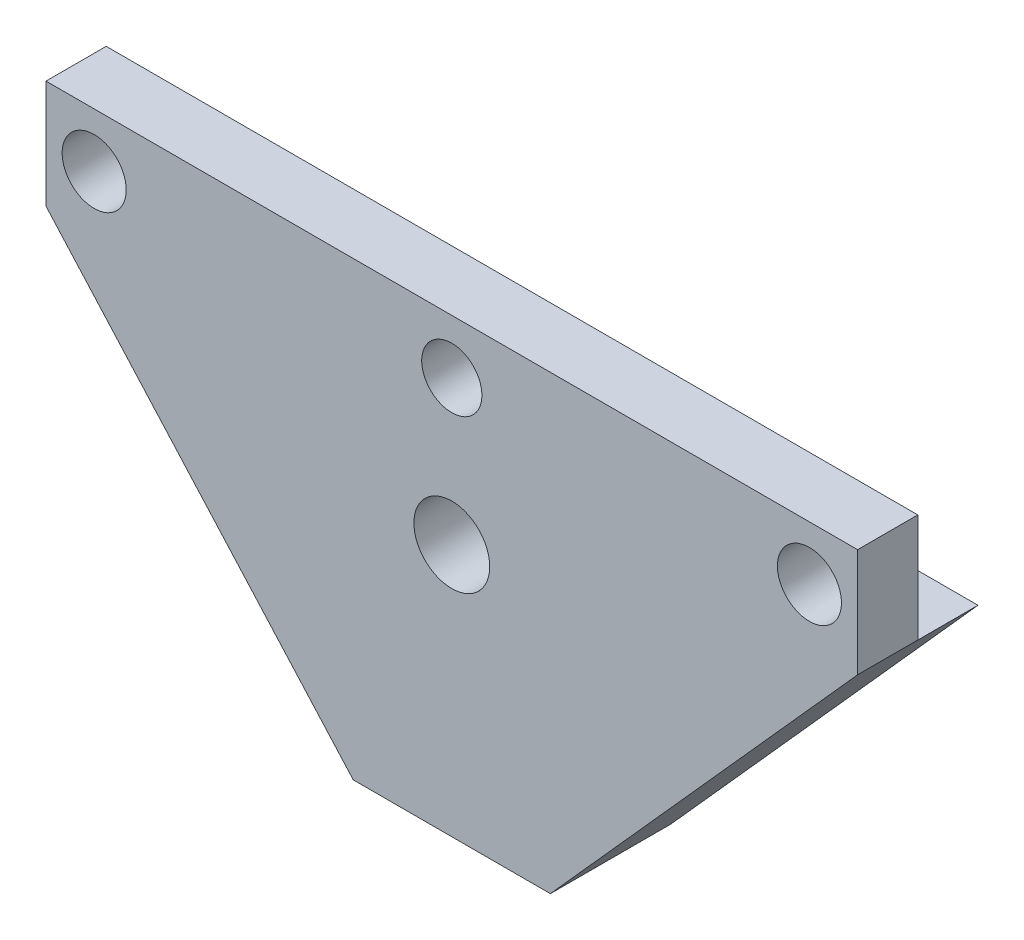
ISO-10303-21;
HEADER;
FILE_DESCRIPTION(('STEP AP214'),'2;1');
FILE_NAME('part.step','',(''),(''),'','','');
FILE_SCHEMA(('AUTOMOTIVE_DESIGN { 1 0 10303 214 1 1 1 1 }'));
ENDSEC;
DATA;
#1=APPLICATION_CONTEXT('core data for automotive mechanical design processes');
#2=APPLICATION_PROTOCOL_DEFINITION('international standard','automotive_design',2000,#1);
#3=PRODUCT_CONTEXT('',#1,'mechanical');
#4=PRODUCT('Part','Part','',(#3));
#5=PRODUCT_RELATED_PRODUCT_CATEGORY('part','',(#4));
#6=PRODUCT_DEFINITION_FORMATION('','',#4);
#7=PRODUCT_DEFINITION_CONTEXT('part definition',#1,'design');
#8=PRODUCT_DEFINITION('design','',#6,#7);
#9=PRODUCT_DEFINITION_SHAPE('','',#8);
#10=(LENGTH_UNIT() NAMED_UNIT(*) SI_UNIT(.MILLI.,.METRE.));
#11=(NAMED_UNIT(*) PLANE_ANGLE_UNIT() SI_UNIT($,.RADIAN.));
#12=(NAMED_UNIT(*) SI_UNIT($,.STERADIAN.) SOLID_ANGLE_UNIT());
#13=UNCERTAINTY_MEASURE_WITH_UNIT(LENGTH_MEASURE(1.E-05),#10,'distance_accuracy_value','');
#14=(GEOMETRIC_REPRESENTATION_CONTEXT(3) GLOBAL_UNCERTAINTY_ASSIGNED_CONTEXT((#13)) GLOBAL_UNIT_ASSIGNED_CONTEXT((#10,
#11,#12)) REPRESENTATION_CONTEXT('',''));
#15=CARTESIAN_POINT('',(0.,0.,0.));
#16=DIRECTION('',(0.,0.,1.));
#17=DIRECTION('',(1.,0.,0.));
#18=AXIS2_PLACEMENT_3D('',#15,#16,#17);
#19=CARTESIAN_POINT('',(-42.8001305488663,-5.71500000000003,-12.7));
#20=DIRECTION('',(-1.,0.,0.));
#21=DIRECTION('',(0.,-1.,0.));
#22=AXIS2_PLACEMENT_3D('',#19,#20,#21);
#23=PLANE('',#22);
#24=DIRECTION('',(0.,-1.,0.));
#25=VECTOR('',#24,1.);
#26=CARTESIAN_POINT('',(-42.8001305488663,5.71500000000011,-6.35));
#27=LINE('',#26,#25);
#28=CARTESIAN_POINT('',(-42.8001305488663,5.71500000000011,-6.35));
#29=VERTEX_POINT('',#28);
#30=CARTESIAN_POINT('',(-42.8001305488663,-5.71499999999991,-6.35));
#31=VERTEX_POINT('',#30);
#32=EDGE_CURVE('E108',#29,#31,#27,.T.);
#33=ORIENTED_EDGE('',*,*,#32,.T.);
#34=DIRECTION('',(0.,0.,1.));
#35=VECTOR('',#34,1.);
#36=CARTESIAN_POINT('',(-42.8001305488663,-5.71500000000003,-12.7));
#37=LINE('',#36,#35);
#38=CARTESIAN_POINT('',(-42.8001305488663,-5.71500000000003,0.));
#39=VERTEX_POINT('',#38);
#40=EDGE_CURVE('E124',#31,#39,#37,.T.);
#41=ORIENTED_EDGE('',*,*,#40,.T.);
#42=DIRECTION('',(0.,-1.,0.));
#43=VECTOR('',#42,1.);
#44=CARTESIAN_POINT('',(-42.8001305488663,-5.71500000000003,0.));
#45=LINE('',#44,#43);
#46=CARTESIAN_POINT('',(-42.8001305488663,5.715,0.));
#47=VERTEX_POINT('',#46);
#48=EDGE_CURVE('E122',#47,#39,#45,.T.);
#49=ORIENTED_EDGE('',*,*,#48,.F.);
#50=DIRECTION('',(0.,0.,1.));
#51=VECTOR('',#50,1.);
#52=CARTESIAN_POINT('',(-42.8001305488663,5.715,-12.7));
#53=LINE('',#52,#51);
#54=EDGE_CURVE('E11',#29,#47,#53,.T.);
#55=ORIENTED_EDGE('',*,*,#54,.F.);
#56=EDGE_LOOP('',(#33,#41,#49,#55));
#57=FACE_BOUND('',#56,.T.);
#58=ADVANCED_FACE('F39',(#57),#23,.T.);
#59=CARTESIAN_POINT('',(-42.8001305488663,5.715,-12.7));
#60=DIRECTION('',(0.,1.,0.));
#61=DIRECTION('',(-1.,0.,0.));
#62=AXIS2_PLACEMENT_3D('',#59,#60,#61);
#63=PLANE('',#62);
#64=DIRECTION('',(1.,0.,0.));
#65=VECTOR('',#64,1.);
#66=CARTESIAN_POINT('',(-42.8001305488663,5.71500000000011,-6.35));
#67=LINE('',#66,#65);
#68=CARTESIAN_POINT('',(42.8001305488663,5.71500000000001,-6.35));
#69=VERTEX_POINT('',#68);
#70=EDGE_CURVE('E112',#29,#69,#67,.T.);
#71=ORIENTED_EDGE('',*,*,#70,.F.);
#72=ORIENTED_EDGE('',*,*,#54,.T.);
#73=DIRECTION('',(-1.,0.,0.));
#74=VECTOR('',#73,1.);
#75=CARTESIAN_POINT('',(-42.8001305488663,5.715,0.));
#76=LINE('',#75,#74);
#77=CARTESIAN_POINT('',(42.8001305488663,5.71500000000001,0.));
#78=VERTEX_POINT('',#77);
#79=EDGE_CURVE('E131',#78,#47,#76,.T.);
#80=ORIENTED_EDGE('',*,*,#79,.F.);
#81=DIRECTION('',(0.,0.,1.));
#82=VECTOR('',#81,1.);
#83=CARTESIAN_POINT('',(42.8001305488663,5.71500000000001,-12.7));
#84=LINE('',#83,#82);
#85=EDGE_CURVE('E48',#69,#78,#84,.T.);
#86=ORIENTED_EDGE('',*,*,#85,.F.);
#87=EDGE_LOOP('',(#71,#72,#80,#86));
#88=FACE_BOUND('',#87,.T.);
#89=ADVANCED_FACE('F119',(#88),#63,.T.);
#90=CARTESIAN_POINT('',(42.8001305488663,-5.71500000000002,-12.7));
#91=DIRECTION('',(1.,0.,0.));
#92=DIRECTION('',(0.,1.,0.));
#93=AXIS2_PLACEMENT_3D('',#90,#91,#92);
#94=PLANE('',#93);
#95=DIRECTION('',(0.,-1.,0.));
#96=VECTOR('',#95,1.);
#97=CARTESIAN_POINT('',(42.8001305488663,5.71500000000001,-6.35));
#98=LINE('',#97,#96);
#99=CARTESIAN_POINT('',(42.8001305488663,-5.71500000000002,-6.35));
#100=VERTEX_POINT('',#99);
#101=EDGE_CURVE('E117',#69,#100,#98,.T.);
#102=ORIENTED_EDGE('',*,*,#101,.F.);
#103=ORIENTED_EDGE('',*,*,#85,.T.);
#104=DIRECTION('',(0.,1.,0.));
#105=VECTOR('',#104,1.);
#106=CARTESIAN_POINT('',(42.8001305488663,-5.71500000000002,0.));
#107=LINE('',#106,#105);
#108=CARTESIAN_POINT('',(42.8001305488663,-5.71500000000002,0.));
#109=VERTEX_POINT('',#108);
#110=EDGE_CURVE('E134',#109,#78,#107,.T.);
#111=ORIENTED_EDGE('',*,*,#110,.F.);
#112=DIRECTION('',(0.,0.,1.));
#113=VECTOR('',#112,1.);
#114=CARTESIAN_POINT('',(42.8001305488663,-5.71500000000002,-12.7));
#115=LINE('',#114,#113);
#116=EDGE_CURVE('E146',#100,#109,#115,.T.);
#117=ORIENTED_EDGE('',*,*,#116,.F.);
#118=EDGE_LOOP('',(#102,#103,#111,#117));
#119=FACE_BOUND('',#118,.T.);
#120=ADVANCED_FACE('F164',(#119),#94,.T.);
#121=CARTESIAN_POINT('',(10.395398020278,-41.91,-12.7));
#122=DIRECTION('',(0.745039441543224,-0.667020412390026,0.));
#123=DIRECTION('',(0.667020412390026,0.745039441543224,0.));
#124=AXIS2_PLACEMENT_3D('',#121,#122,#123);
#125=PLANE('',#124);
#126=DIRECTION('',(0.667020412390026,0.745039441543224,0.));
#127=VECTOR('',#126,1.);
#128=CARTESIAN_POINT('',(10.395398020278,-41.91,0.));
#129=LINE('',#128,#127);
#130=CARTESIAN_POINT('',(10.395398020278,-41.91,0.));
#131=VERTEX_POINT('',#130);
#132=EDGE_CURVE('E140',#131,#109,#129,.T.);
#133=ORIENTED_EDGE('',*,*,#132,.F.);
#134=DIRECTION('',(0.,0.,1.));
#135=VECTOR('',#134,1.);
#136=CARTESIAN_POINT('',(10.395398020278,-41.91,-12.7));
#137=LINE('',#136,#135);
#138=CARTESIAN_POINT('',(10.395398020278,-41.91,-12.7));
#139=VERTEX_POINT('',#138);
#140=EDGE_CURVE('E147',#139,#131,#137,.T.);
#141=ORIENTED_EDGE('',*,*,#140,.F.);
#142=DIRECTION('',(0.667020412390026,0.745039441543224,0.));
#143=VECTOR('',#142,1.);
#144=CARTESIAN_POINT('',(10.395398020278,-41.91,-12.7));
#145=LINE('',#144,#143);
#146=CARTESIAN_POINT('',(42.8001305488663,-5.71500000000002,-12.7));
#147=VERTEX_POINT('',#146);
#148=EDGE_CURVE('E151',#139,#147,#145,.T.);
#149=ORIENTED_EDGE('',*,*,#148,.T.);
#150=EDGE_CURVE('E57',#147,#100,#115,.T.);
#151=ORIENTED_EDGE('',*,*,#150,.T.);
#152=ORIENTED_EDGE('',*,*,#116,.T.);
#153=EDGE_LOOP('',(#133,#141,#149,#151,#152));
#154=FACE_BOUND('',#153,.T.);
#155=ADVANCED_FACE('F162',(#154),#125,.T.);
#156=CARTESIAN_POINT('',(-10.395398020278,-41.91,-12.7));
#157=DIRECTION('',(0.,-1.,0.));
#158=DIRECTION('',(0.,0.,-1.));
#159=AXIS2_PLACEMENT_3D('',#156,#157,#158);
#160=PLANE('',#159);
#161=DIRECTION('',(1.,0.,0.));
#162=VECTOR('',#161,1.);
#163=CARTESIAN_POINT('',(-10.395398020278,-41.91,0.));
#164=LINE('',#163,#162);
#165=CARTESIAN_POINT('',(-10.395398020278,-41.91,0.));
#166=VERTEX_POINT('',#165);
#167=EDGE_CURVE('E159',#166,#131,#164,.T.);
#168=ORIENTED_EDGE('',*,*,#167,.F.);
#169=DIRECTION('',(0.,0.,1.));
#170=VECTOR('',#169,1.);
#171=CARTESIAN_POINT('',(-10.395398020278,-41.91,-12.7));
#172=LINE('',#171,#170);
#173=CARTESIAN_POINT('',(-10.395398020278,-41.91,-12.7));
#174=VERTEX_POINT('',#173);
#175=EDGE_CURVE('E92',#174,#166,#172,.T.);
#176=ORIENTED_EDGE('',*,*,#175,.F.);
#177=DIRECTION('',(1.,0.,0.));
#178=VECTOR('',#177,1.);
#179=CARTESIAN_POINT('',(-10.395398020278,-41.91,-12.7));
#180=LINE('',#179,#178);
#181=EDGE_CURVE('E138',#174,#139,#180,.T.);
#182=ORIENTED_EDGE('',*,*,#181,.T.);
#183=ORIENTED_EDGE('',*,*,#140,.T.);
#184=EDGE_LOOP('',(#168,#176,#182,#183));
#185=FACE_BOUND('',#184,.T.);
#186=ADVANCED_FACE('F171',(#185),#160,.T.);
#187=CARTESIAN_POINT('',(-42.8001305488663,-5.71500000000003,-12.7));
#188=DIRECTION('',(-0.745039441543224,-0.667020412390026,0.));
#189=DIRECTION('',(0.667020412390026,-0.745039441543224,0.));
#190=AXIS2_PLACEMENT_3D('',#187,#188,#189);
#191=PLANE('',#190);
#192=DIRECTION('',(0.667020412390026,-0.745039441543224,0.));
#193=VECTOR('',#192,1.);
#194=CARTESIAN_POINT('',(-42.8001305488663,-5.71500000000003,0.));
#195=LINE('',#194,#193);
#196=EDGE_CURVE('E128',#39,#166,#195,.T.);
#197=ORIENTED_EDGE('',*,*,#196,.F.);
#198=ORIENTED_EDGE('',*,*,#40,.F.);
#199=CARTESIAN_POINT('',(-42.8001305488663,-5.71499999999991,-12.7));
#200=VERTEX_POINT('',#199);
#201=EDGE_CURVE('E149',#200,#31,#37,.T.);
#202=ORIENTED_EDGE('',*,*,#201,.F.);
#203=DIRECTION('',(0.667020412390026,-0.745039441543224,0.));
#204=VECTOR('',#203,1.);
#205=CARTESIAN_POINT('',(-42.8001305488663,-5.71500000000003,-12.7));
#206=LINE('',#205,#204);
#207=EDGE_CURVE('E135',#200,#174,#206,.T.);
#208=ORIENTED_EDGE('',*,*,#207,.T.);
#209=ORIENTED_EDGE('',*,*,#175,.T.);
#210=EDGE_LOOP('',(#197,#198,#202,#208,#209));
#211=FACE_BOUND('',#210,.T.);
#212=ADVANCED_FACE('F199',(#211),#191,.T.);
#213=CARTESIAN_POINT('',(0.,0.,-12.7));
#214=DIRECTION('',(0.,0.,-1.));
#215=DIRECTION('',(-1.,0.,0.));
#216=AXIS2_PLACEMENT_3D('',#213,#214,#215);
#217=PLANE('',#216);
#218=CARTESIAN_POINT('',(0.,-15.24,-12.7));
#219=DIRECTION('',(0.,0.,1.));
#220=DIRECTION('',(1.,0.,0.));
#221=AXIS2_PLACEMENT_3D('',#218,#219,#220);
#222=CIRCLE('',#221,4.);
#223=CARTESIAN_POINT('',(4.,-15.24,-12.7));
#224=VERTEX_POINT('',#223);
#225=EDGE_CURVE('E301',#224,#224,#222,.T.);
#226=ORIENTED_EDGE('',*,*,#225,.T.);
#227=EDGE_LOOP('',(#226));
#228=FACE_BOUND('',#227,.T.);
#229=DIRECTION('',(1.,0.,0.));
#230=VECTOR('',#229,1.);
#231=CARTESIAN_POINT('',(-42.8001305488663,-5.71499999999991,-12.7));
#232=LINE('',#231,#230);
#233=EDGE_CURVE('E307',#200,#147,#232,.T.);
#234=ORIENTED_EDGE('',*,*,#233,.T.);
#235=ORIENTED_EDGE('',*,*,#148,.F.);
#236=ORIENTED_EDGE('',*,*,#181,.F.);
#237=ORIENTED_EDGE('',*,*,#207,.F.);
#238=EDGE_LOOP('',(#234,#235,#236,#237));
#239=FACE_BOUND('',#238,.T.);
#240=ADVANCED_FACE('F204',(#228,#239),#217,.T.);
#241=CARTESIAN_POINT('',(0.,0.,0.));
#242=DIRECTION('',(0.,0.,-1.));
#243=DIRECTION('',(-1.,0.,0.));
#244=AXIS2_PLACEMENT_3D('',#241,#242,#243);
#245=PLANE('',#244);
#246=CARTESIAN_POINT('',(37.7201305488663,0.,0.));
#247=DIRECTION('',(0.,0.,-1.));
#248=DIRECTION('',(0.,1.,0.));
#249=AXIS2_PLACEMENT_3D('',#246,#247,#248);
#250=CIRCLE('',#249,3.3782);
#251=CARTESIAN_POINT('',(37.7201305488663,3.3782,0.));
#252=VERTEX_POINT('',#251);
#253=EDGE_CURVE('E287',#252,#252,#250,.T.);
#254=ORIENTED_EDGE('',*,*,#253,.T.);
#255=EDGE_LOOP('',(#254));
#256=FACE_BOUND('',#255,.T.);
#257=CARTESIAN_POINT('',(-37.7201305488663,0.,0.));
#258=DIRECTION('',(0.,0.,-1.));
#259=DIRECTION('',(0.,1.,0.));
#260=AXIS2_PLACEMENT_3D('',#257,#258,#259);
#261=CIRCLE('',#260,3.3782);
#262=CARTESIAN_POINT('',(-37.7201305488663,3.3782,0.));
#263=VERTEX_POINT('',#262);
#264=EDGE_CURVE('E297',#263,#263,#261,.T.);
#265=ORIENTED_EDGE('',*,*,#264,.T.);
#266=EDGE_LOOP('',(#265));
#267=FACE_BOUND('',#266,.T.);
#268=CARTESIAN_POINT('',(0.,-15.24,0.));
#269=DIRECTION('',(0.,0.,1.));
#270=DIRECTION('',(1.,0.,0.));
#271=AXIS2_PLACEMENT_3D('',#268,#269,#270);
#272=CIRCLE('',#271,4.);
#273=CARTESIAN_POINT('',(4.,-15.24,0.));
#274=VERTEX_POINT('',#273);
#275=EDGE_CURVE('E300',#274,#274,#272,.T.);
#276=ORIENTED_EDGE('',*,*,#275,.F.);
#277=EDGE_LOOP('',(#276));
#278=FACE_BOUND('',#277,.T.);
#279=CARTESIAN_POINT('',(0.,0.,0.));
#280=DIRECTION('',(0.,0.,1.));
#281=DIRECTION('',(1.,0.,0.));
#282=AXIS2_PLACEMENT_3D('',#279,#280,#281);
#283=CIRCLE('',#282,3.175);
#284=CARTESIAN_POINT('',(3.175,0.,0.));
#285=VERTEX_POINT('',#284);
#286=EDGE_CURVE('E129',#285,#285,#283,.T.);
#287=ORIENTED_EDGE('',*,*,#286,.F.);
#288=EDGE_LOOP('',(#287));
#289=FACE_BOUND('',#288,.T.);
#290=ORIENTED_EDGE('',*,*,#48,.T.);
#291=ORIENTED_EDGE('',*,*,#196,.T.);
#292=ORIENTED_EDGE('',*,*,#167,.T.);
#293=ORIENTED_EDGE('',*,*,#132,.T.);
#294=ORIENTED_EDGE('',*,*,#110,.T.);
#295=ORIENTED_EDGE('',*,*,#79,.T.);
#296=EDGE_LOOP('',(#290,#291,#292,#293,#294,#295));
#297=FACE_BOUND('',#296,.T.);
#298=ADVANCED_FACE('F132',(#256,#267,#278,#289,#297),#245,.F.);
#299=CARTESIAN_POINT('',(0.,0.,-12.7));
#300=DIRECTION('',(0.,0.,1.));
#301=DIRECTION('',(1.,0.,0.));
#302=AXIS2_PLACEMENT_3D('',#299,#300,#301);
#303=CYLINDRICAL_SURFACE('',#302,3.175);
#304=CARTESIAN_POINT('',(0.,0.,-6.35));
#305=DIRECTION('',(0.,0.,1.));
#306=DIRECTION('',(0.,-1.,0.));
#307=AXIS2_PLACEMENT_3D('',#304,#305,#306);
#308=CIRCLE('',#307,3.175);
#309=CARTESIAN_POINT('',(0.,-3.175,-6.35));
#310=VERTEX_POINT('',#309);
#311=EDGE_CURVE('E42',#310,#310,#308,.F.);
#312=ORIENTED_EDGE('',*,*,#311,.T.);
#313=EDGE_LOOP('',(#312));
#314=FACE_BOUND('',#313,.T.);
#315=ORIENTED_EDGE('',*,*,#286,.T.);
#316=EDGE_LOOP('',(#315));
#317=FACE_BOUND('',#316,.T.);
#318=ADVANCED_FACE('F211',(#314,#317),#303,.F.);
#319=CARTESIAN_POINT('',(-42.8001305488663,5.71500000000011,-6.35));
#320=DIRECTION('',(0.,0.,1.));
#321=DIRECTION('',(0.,-1.,0.));
#322=AXIS2_PLACEMENT_3D('',#319,#320,#321);
#323=PLANE('',#322);
#324=CARTESIAN_POINT('',(37.7201305488663,0.,-6.35));
#325=DIRECTION('',(0.,0.,-1.));
#326=DIRECTION('',(0.,1.,0.));
#327=AXIS2_PLACEMENT_3D('',#324,#325,#326);
#328=CIRCLE('',#327,3.3782);
#329=CARTESIAN_POINT('',(37.7201305488663,3.3782,-6.35));
#330=VERTEX_POINT('',#329);
#331=EDGE_CURVE('E290',#330,#330,#328,.T.);
#332=ORIENTED_EDGE('',*,*,#331,.F.);
#333=EDGE_LOOP('',(#332));
#334=FACE_BOUND('',#333,.T.);
#335=CARTESIAN_POINT('',(-37.7201305488663,0.,-6.35));
#336=DIRECTION('',(0.,0.,-1.));
#337=DIRECTION('',(0.,1.,0.));
#338=AXIS2_PLACEMENT_3D('',#335,#336,#337);
#339=CIRCLE('',#338,3.3782);
#340=CARTESIAN_POINT('',(-37.7201305488663,3.3782,-6.35));
#341=VERTEX_POINT('',#340);
#342=EDGE_CURVE('E292',#341,#341,#339,.T.);
#343=ORIENTED_EDGE('',*,*,#342,.F.);
#344=EDGE_LOOP('',(#343));
#345=FACE_BOUND('',#344,.T.);
#346=ORIENTED_EDGE('',*,*,#101,.T.);
#347=DIRECTION('',(1.,0.,0.));
#348=VECTOR('',#347,1.);
#349=CARTESIAN_POINT('',(-42.8001305488663,-5.71499999999991,-6.35));
#350=LINE('',#349,#348);
#351=EDGE_CURVE('E113',#31,#100,#350,.T.);
#352=ORIENTED_EDGE('',*,*,#351,.F.);
#353=ORIENTED_EDGE('',*,*,#32,.F.);
#354=ORIENTED_EDGE('',*,*,#70,.T.);
#355=EDGE_LOOP('',(#346,#352,#353,#354));
#356=FACE_BOUND('',#355,.T.);
#357=ORIENTED_EDGE('',*,*,#311,.F.);
#358=EDGE_LOOP('',(#357));
#359=FACE_BOUND('',#358,.T.);
#360=ADVANCED_FACE('F110',(#334,#345,#356,#359),#323,.F.);
#361=CARTESIAN_POINT('',(-42.8001305488663,-5.71499999999991,-12.7));
#362=DIRECTION('',(0.,-1.,0.));
#363=DIRECTION('',(1.,0.,0.));
#364=AXIS2_PLACEMENT_3D('',#361,#362,#363);
#365=PLANE('',#364);
#366=ORIENTED_EDGE('',*,*,#150,.F.);
#367=ORIENTED_EDGE('',*,*,#233,.F.);
#368=ORIENTED_EDGE('',*,*,#201,.T.);
#369=ORIENTED_EDGE('',*,*,#351,.T.);
#370=EDGE_LOOP('',(#366,#367,#368,#369));
#371=FACE_BOUND('',#370,.T.);
#372=ADVANCED_FACE('F225',(#371),#365,.F.);
#373=CARTESIAN_POINT('',(0.,-15.24,-12.7));
#374=DIRECTION('',(0.,0.,1.));
#375=DIRECTION('',(1.,0.,0.));
#376=AXIS2_PLACEMENT_3D('',#373,#374,#375);
#377=CYLINDRICAL_SURFACE('',#376,4.);
#378=ORIENTED_EDGE('',*,*,#225,.F.);
#379=EDGE_LOOP('',(#378));
#380=FACE_BOUND('',#379,.T.);
#381=ORIENTED_EDGE('',*,*,#275,.T.);
#382=EDGE_LOOP('',(#381));
#383=FACE_BOUND('',#382,.T.);
#384=ADVANCED_FACE('F230',(#380,#383),#377,.F.);
#385=CARTESIAN_POINT('',(-37.7201305488663,0.,-6.35));
#386=DIRECTION('',(0.,0.,-1.));
#387=DIRECTION('',(0.,1.,0.));
#388=AXIS2_PLACEMENT_3D('',#385,#386,#387);
#389=CYLINDRICAL_SURFACE('',#388,3.3782);
#390=ORIENTED_EDGE('',*,*,#264,.F.);
#391=EDGE_LOOP('',(#390));
#392=FACE_BOUND('',#391,.T.);
#393=ORIENTED_EDGE('',*,*,#342,.T.);
#394=EDGE_LOOP('',(#393));
#395=FACE_BOUND('',#394,.T.);
#396=ADVANCED_FACE('F246',(#392,#395),#389,.F.);
#397=CARTESIAN_POINT('',(37.7201305488663,0.,-6.35));
#398=DIRECTION('',(0.,0.,-1.));
#399=DIRECTION('',(0.,1.,0.));
#400=AXIS2_PLACEMENT_3D('',#397,#398,#399);
#401=CYLINDRICAL_SURFACE('',#400,3.3782);
#402=ORIENTED_EDGE('',*,*,#253,.F.);
#403=EDGE_LOOP('',(#402));
#404=FACE_BOUND('',#403,.T.);
#405=ORIENTED_EDGE('',*,*,#331,.T.);
#406=EDGE_LOOP('',(#405));
#407=FACE_BOUND('',#406,.T.);
#408=ADVANCED_FACE('F270',(#404,#407),#401,.F.);
#409=CLOSED_SHELL('',(#58,#89,#120,#155,#186,#212,#240,#298,#318,#360,#372,#384,#396,#408));
#410=MANIFOLD_SOLID_BREP('B2',#409);
#411=ADVANCED_BREP_SHAPE_REPRESENTATION('',(#18,#410),#14);
#412=SHAPE_DEFINITION_REPRESENTATION(#9,#411);
ENDSEC;
END-ISO-10303-21;
